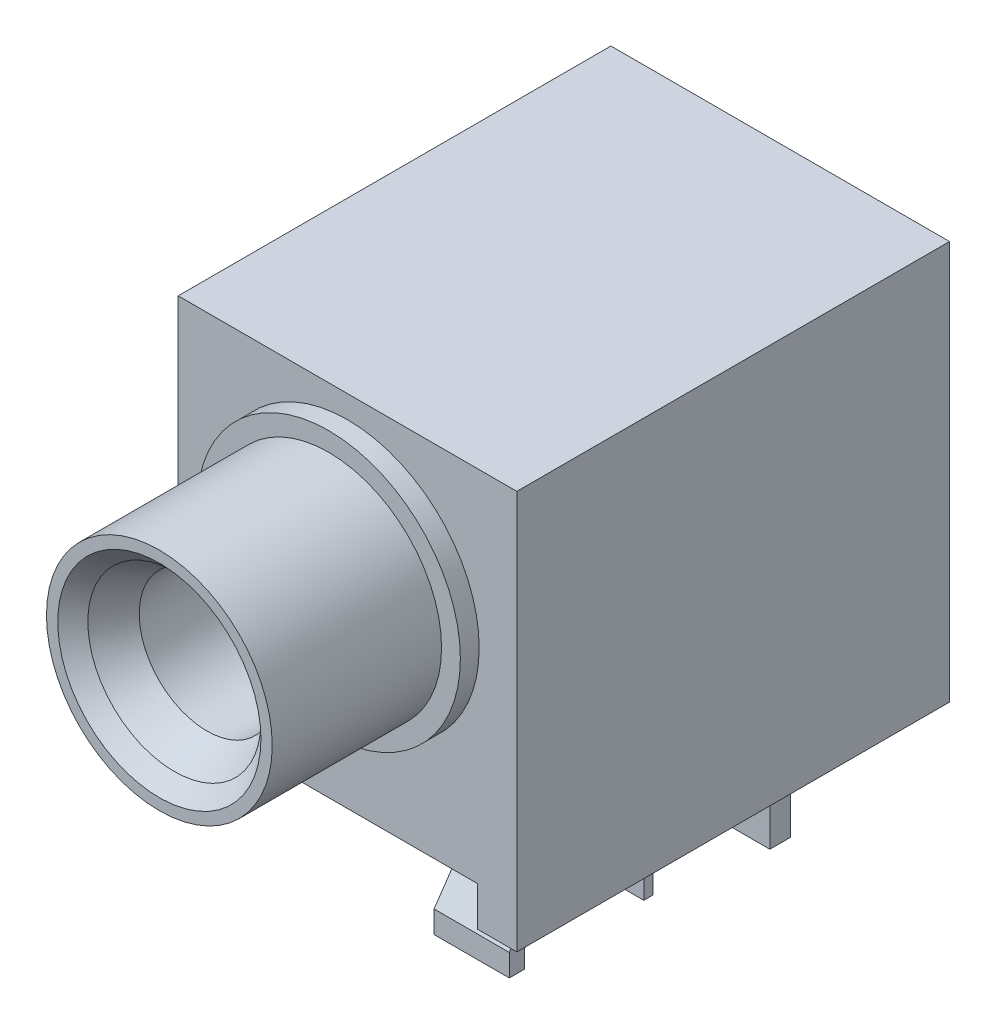
ISO-10303-21;
HEADER;
FILE_DESCRIPTION(('STEP AP214'),'2;1');
FILE_NAME('part.step','',(''),(''),'','','');
FILE_SCHEMA(('AUTOMOTIVE_DESIGN { 1 0 10303 214 1 1 1 1 }'));
ENDSEC;
DATA;
#1=APPLICATION_CONTEXT('core data for automotive mechanical design processes');
#2=APPLICATION_PROTOCOL_DEFINITION('international standard','automotive_design',2000,#1);
#3=PRODUCT_CONTEXT('',#1,'mechanical');
#4=PRODUCT('Part','Part','',(#3));
#5=PRODUCT_RELATED_PRODUCT_CATEGORY('part','',(#4));
#6=PRODUCT_DEFINITION_FORMATION('','',#4);
#7=PRODUCT_DEFINITION_CONTEXT('part definition',#1,'design');
#8=PRODUCT_DEFINITION('design','',#6,#7);
#9=PRODUCT_DEFINITION_SHAPE('','',#8);
#10=(LENGTH_UNIT() NAMED_UNIT(*) SI_UNIT(.MILLI.,.METRE.));
#11=(NAMED_UNIT(*) PLANE_ANGLE_UNIT() SI_UNIT($,.RADIAN.));
#12=(NAMED_UNIT(*) SI_UNIT($,.STERADIAN.) SOLID_ANGLE_UNIT());
#13=UNCERTAINTY_MEASURE_WITH_UNIT(LENGTH_MEASURE(1.E-05),#10,'distance_accuracy_value','');
#14=(GEOMETRIC_REPRESENTATION_CONTEXT(3) GLOBAL_UNCERTAINTY_ASSIGNED_CONTEXT((#13)) GLOBAL_UNIT_ASSIGNED_CONTEXT((#10,
#11,#12)) REPRESENTATION_CONTEXT('',''));
#15=CARTESIAN_POINT('',(0.,0.,0.));
#16=DIRECTION('',(0.,0.,1.));
#17=DIRECTION('',(1.,0.,0.));
#18=AXIS2_PLACEMENT_3D('',#15,#16,#17);
#19=CARTESIAN_POINT('',(1.,1.05,-10.225));
#20=DIRECTION('',(0.,0.,-1.));
#21=DIRECTION('',(-1.,0.,0.));
#22=AXIS2_PLACEMENT_3D('',#19,#20,#21);
#23=PLANE('',#22);
#24=DIRECTION('',(0.,-1.,0.));
#25=VECTOR('',#24,1.);
#26=CARTESIAN_POINT('',(-1.,1.05,-10.225));
#27=LINE('',#26,#25);
#28=CARTESIAN_POINT('',(-1.,1.05,-10.225));
#29=VERTEX_POINT('',#28);
#30=CARTESIAN_POINT('',(-1.,-4.5,-10.225));
#31=VERTEX_POINT('',#30);
#32=EDGE_CURVE('E109',#29,#31,#27,.T.);
#33=ORIENTED_EDGE('',*,*,#32,.T.);
#34=DIRECTION('',(-1.,0.,0.));
#35=VECTOR('',#34,1.);
#36=CARTESIAN_POINT('',(1.,-4.5,-10.225));
#37=LINE('',#36,#35);
#38=CARTESIAN_POINT('',(1.,-4.5,-10.225));
#39=VERTEX_POINT('',#38);
#40=EDGE_CURVE('E12',#39,#31,#37,.T.);
#41=ORIENTED_EDGE('',*,*,#40,.F.);
#42=DIRECTION('',(0.,-1.,0.));
#43=VECTOR('',#42,1.);
#44=CARTESIAN_POINT('',(1.,1.05,-10.225));
#45=LINE('',#44,#43);
#46=CARTESIAN_POINT('',(1.,1.05,-10.225));
#47=VERTEX_POINT('',#46);
#48=EDGE_CURVE('E97',#47,#39,#45,.T.);
#49=ORIENTED_EDGE('',*,*,#48,.F.);
#50=DIRECTION('',(-1.,0.,0.));
#51=VECTOR('',#50,1.);
#52=CARTESIAN_POINT('',(1.,1.05,-10.225));
#53=LINE('',#52,#51);
#54=EDGE_CURVE('E105',#47,#29,#53,.T.);
#55=ORIENTED_EDGE('',*,*,#54,.T.);
#56=EDGE_LOOP('',(#33,#41,#49,#55));
#57=FACE_BOUND('',#56,.T.);
#58=ADVANCED_FACE('F46',(#57),#23,.F.);
#59=CARTESIAN_POINT('',(1.,-4.5,-10.225));
#60=DIRECTION('',(0.,1.,0.));
#61=DIRECTION('',(0.,0.,1.));
#62=AXIS2_PLACEMENT_3D('',#59,#60,#61);
#63=PLANE('',#62);
#64=DIRECTION('',(0.,0.,-1.));
#65=VECTOR('',#64,1.);
#66=CARTESIAN_POINT('',(-1.,-4.5,-10.225));
#67=LINE('',#66,#65);
#68=CARTESIAN_POINT('',(-1.,-4.5,-10.775));
#69=VERTEX_POINT('',#68);
#70=EDGE_CURVE('E101',#31,#69,#67,.T.);
#71=ORIENTED_EDGE('',*,*,#70,.T.);
#72=DIRECTION('',(-1.,0.,0.));
#73=VECTOR('',#72,1.);
#74=CARTESIAN_POINT('',(1.,-4.5,-10.775));
#75=LINE('',#74,#73);
#76=CARTESIAN_POINT('',(1.,-4.5,-10.775));
#77=VERTEX_POINT('',#76);
#78=EDGE_CURVE('E54',#77,#69,#75,.T.);
#79=ORIENTED_EDGE('',*,*,#78,.F.);
#80=DIRECTION('',(0.,0.,-1.));
#81=VECTOR('',#80,1.);
#82=CARTESIAN_POINT('',(1.,-4.5,-10.225));
#83=LINE('',#82,#81);
#84=EDGE_CURVE('E92',#39,#77,#83,.T.);
#85=ORIENTED_EDGE('',*,*,#84,.F.);
#86=ORIENTED_EDGE('',*,*,#40,.T.);
#87=EDGE_LOOP('',(#71,#79,#85,#86));
#88=FACE_BOUND('',#87,.T.);
#89=ADVANCED_FACE('F100',(#88),#63,.F.);
#90=CARTESIAN_POINT('',(1.,1.05,-10.775));
#91=DIRECTION('',(0.,0.,1.));
#92=DIRECTION('',(0.,-1.,0.));
#93=AXIS2_PLACEMENT_3D('',#90,#91,#92);
#94=PLANE('',#93);
#95=DIRECTION('',(0.,1.,0.));
#96=VECTOR('',#95,1.);
#97=CARTESIAN_POINT('',(-1.,1.05,-10.775));
#98=LINE('',#97,#96);
#99=CARTESIAN_POINT('',(-1.,1.05,-10.775));
#100=VERTEX_POINT('',#99);
#101=EDGE_CURVE('E79',#69,#100,#98,.T.);
#102=ORIENTED_EDGE('',*,*,#101,.T.);
#103=DIRECTION('',(-1.,0.,0.));
#104=VECTOR('',#103,1.);
#105=CARTESIAN_POINT('',(1.,1.05,-10.775));
#106=LINE('',#105,#104);
#107=CARTESIAN_POINT('',(1.,1.05,-10.775));
#108=VERTEX_POINT('',#107);
#109=EDGE_CURVE('E102',#108,#100,#106,.T.);
#110=ORIENTED_EDGE('',*,*,#109,.F.);
#111=DIRECTION('',(0.,1.,0.));
#112=VECTOR('',#111,1.);
#113=CARTESIAN_POINT('',(1.,1.05,-10.775));
#114=LINE('',#113,#112);
#115=EDGE_CURVE('E95',#77,#108,#114,.T.);
#116=ORIENTED_EDGE('',*,*,#115,.F.);
#117=ORIENTED_EDGE('',*,*,#78,.T.);
#118=EDGE_LOOP('',(#102,#110,#116,#117));
#119=FACE_BOUND('',#118,.T.);
#120=ADVANCED_FACE('F103',(#119),#94,.F.);
#121=CARTESIAN_POINT('',(1.,1.05,-10.225));
#122=DIRECTION('',(0.,-1.,0.));
#123=DIRECTION('',(0.,0.,-1.));
#124=AXIS2_PLACEMENT_3D('',#121,#122,#123);
#125=PLANE('',#124);
#126=DIRECTION('',(0.,0.,1.));
#127=VECTOR('',#126,1.);
#128=CARTESIAN_POINT('',(-1.,1.05,-10.225));
#129=LINE('',#128,#127);
#130=EDGE_CURVE('E85',#100,#29,#129,.T.);
#131=ORIENTED_EDGE('',*,*,#130,.T.);
#132=ORIENTED_EDGE('',*,*,#54,.F.);
#133=DIRECTION('',(0.,0.,1.));
#134=VECTOR('',#133,1.);
#135=CARTESIAN_POINT('',(1.,1.05,-10.225));
#136=LINE('',#135,#134);
#137=EDGE_CURVE('E62',#108,#47,#136,.T.);
#138=ORIENTED_EDGE('',*,*,#137,.F.);
#139=ORIENTED_EDGE('',*,*,#109,.T.);
#140=EDGE_LOOP('',(#131,#132,#138,#139));
#141=FACE_BOUND('',#140,.T.);
#142=ADVANCED_FACE('F116',(#141),#125,.F.);
#143=CARTESIAN_POINT('',(1.,0.,0.));
#144=DIRECTION('',(1.,0.,0.));
#145=DIRECTION('',(0.,0.,-1.));
#146=AXIS2_PLACEMENT_3D('',#143,#144,#145);
#147=PLANE('',#146);
#148=ORIENTED_EDGE('',*,*,#48,.T.);
#149=ORIENTED_EDGE('',*,*,#84,.T.);
#150=ORIENTED_EDGE('',*,*,#115,.T.);
#151=ORIENTED_EDGE('',*,*,#137,.T.);
#152=EDGE_LOOP('',(#148,#149,#150,#151));
#153=FACE_BOUND('',#152,.T.);
#154=ADVANCED_FACE('F93',(#153),#147,.T.);
#155=CARTESIAN_POINT('',(-1.,0.,0.));
#156=DIRECTION('',(1.,0.,0.));
#157=DIRECTION('',(0.,0.,-1.));
#158=AXIS2_PLACEMENT_3D('',#155,#156,#157);
#159=PLANE('',#158);
#160=ORIENTED_EDGE('',*,*,#32,.F.);
#161=ORIENTED_EDGE('',*,*,#130,.F.);
#162=ORIENTED_EDGE('',*,*,#101,.F.);
#163=ORIENTED_EDGE('',*,*,#70,.F.);
#164=EDGE_LOOP('',(#160,#161,#162,#163));
#165=FACE_BOUND('',#164,.T.);
#166=ADVANCED_FACE('F119',(#165),#159,.F.);
#167=CLOSED_SHELL('',(#58,#89,#120,#142,#154,#166));
#168=MANIFOLD_SOLID_BREP('B2',#167);
#169=CARTESIAN_POINT('',(1.,1.05,-6.875));
#170=DIRECTION('',(0.,0.,-1.));
#171=DIRECTION('',(-1.,0.,0.));
#172=AXIS2_PLACEMENT_3D('',#169,#170,#171);
#173=PLANE('',#172);
#174=DIRECTION('',(0.,-1.,0.));
#175=VECTOR('',#174,1.);
#176=CARTESIAN_POINT('',(-1.,1.05,-6.875));
#177=LINE('',#176,#175);
#178=CARTESIAN_POINT('',(-1.,1.05,-6.875));
#179=VERTEX_POINT('',#178);
#180=CARTESIAN_POINT('',(-1.,-4.,-6.875));
#181=VERTEX_POINT('',#180);
#182=EDGE_CURVE('E243',#179,#181,#177,.T.);
#183=ORIENTED_EDGE('',*,*,#182,.T.);
#184=DIRECTION('',(-1.,0.,0.));
#185=VECTOR('',#184,1.);
#186=CARTESIAN_POINT('',(1.,-4.,-6.875));
#187=LINE('',#186,#185);
#188=CARTESIAN_POINT('',(1.,-4.,-6.875));
#189=VERTEX_POINT('',#188);
#190=EDGE_CURVE('E44',#189,#181,#187,.T.);
#191=ORIENTED_EDGE('',*,*,#190,.F.);
#192=DIRECTION('',(0.,-1.,0.));
#193=VECTOR('',#192,1.);
#194=CARTESIAN_POINT('',(1.,1.05,-6.875));
#195=LINE('',#194,#193);
#196=CARTESIAN_POINT('',(1.,1.05,-6.875));
#197=VERTEX_POINT('',#196);
#198=EDGE_CURVE('E231',#197,#189,#195,.T.);
#199=ORIENTED_EDGE('',*,*,#198,.F.);
#200=DIRECTION('',(-1.,0.,0.));
#201=VECTOR('',#200,1.);
#202=CARTESIAN_POINT('',(1.,1.05,-6.875));
#203=LINE('',#202,#201);
#204=EDGE_CURVE('E239',#197,#179,#203,.T.);
#205=ORIENTED_EDGE('',*,*,#204,.T.);
#206=EDGE_LOOP('',(#183,#191,#199,#205));
#207=FACE_BOUND('',#206,.T.);
#208=ADVANCED_FACE('F180',(#207),#173,.F.);
#209=CARTESIAN_POINT('',(1.,-4.,-6.875));
#210=DIRECTION('',(0.,1.,0.));
#211=DIRECTION('',(0.,0.,1.));
#212=AXIS2_PLACEMENT_3D('',#209,#210,#211);
#213=PLANE('',#212);
#214=DIRECTION('',(0.,0.,-1.));
#215=VECTOR('',#214,1.);
#216=CARTESIAN_POINT('',(-1.,-4.,-6.875));
#217=LINE('',#216,#215);
#218=CARTESIAN_POINT('',(-1.,-4.,-7.125));
#219=VERTEX_POINT('',#218);
#220=EDGE_CURVE('E235',#181,#219,#217,.T.);
#221=ORIENTED_EDGE('',*,*,#220,.T.);
#222=DIRECTION('',(-1.,0.,0.));
#223=VECTOR('',#222,1.);
#224=CARTESIAN_POINT('',(1.,-4.,-7.125));
#225=LINE('',#224,#223);
#226=CARTESIAN_POINT('',(1.,-4.,-7.125));
#227=VERTEX_POINT('',#226);
#228=EDGE_CURVE('E188',#227,#219,#225,.T.);
#229=ORIENTED_EDGE('',*,*,#228,.F.);
#230=DIRECTION('',(0.,0.,-1.));
#231=VECTOR('',#230,1.);
#232=CARTESIAN_POINT('',(1.,-4.,-6.875));
#233=LINE('',#232,#231);
#234=EDGE_CURVE('E226',#189,#227,#233,.T.);
#235=ORIENTED_EDGE('',*,*,#234,.F.);
#236=ORIENTED_EDGE('',*,*,#190,.T.);
#237=EDGE_LOOP('',(#221,#229,#235,#236));
#238=FACE_BOUND('',#237,.T.);
#239=ADVANCED_FACE('F234',(#238),#213,.F.);
#240=CARTESIAN_POINT('',(1.,1.05,-7.125));
#241=DIRECTION('',(0.,0.,1.));
#242=DIRECTION('',(0.,-1.,0.));
#243=AXIS2_PLACEMENT_3D('',#240,#241,#242);
#244=PLANE('',#243);
#245=DIRECTION('',(0.,1.,0.));
#246=VECTOR('',#245,1.);
#247=CARTESIAN_POINT('',(-1.,1.05,-7.125));
#248=LINE('',#247,#246);
#249=CARTESIAN_POINT('',(-1.,1.05,-7.125));
#250=VERTEX_POINT('',#249);
#251=EDGE_CURVE('E213',#219,#250,#248,.T.);
#252=ORIENTED_EDGE('',*,*,#251,.T.);
#253=DIRECTION('',(-1.,0.,0.));
#254=VECTOR('',#253,1.);
#255=CARTESIAN_POINT('',(1.,1.05,-7.125));
#256=LINE('',#255,#254);
#257=CARTESIAN_POINT('',(1.,1.05,-7.125));
#258=VERTEX_POINT('',#257);
#259=EDGE_CURVE('E236',#258,#250,#256,.T.);
#260=ORIENTED_EDGE('',*,*,#259,.F.);
#261=DIRECTION('',(0.,1.,0.));
#262=VECTOR('',#261,1.);
#263=CARTESIAN_POINT('',(1.,1.05,-7.125));
#264=LINE('',#263,#262);
#265=EDGE_CURVE('E229',#227,#258,#264,.T.);
#266=ORIENTED_EDGE('',*,*,#265,.F.);
#267=ORIENTED_EDGE('',*,*,#228,.T.);
#268=EDGE_LOOP('',(#252,#260,#266,#267));
#269=FACE_BOUND('',#268,.T.);
#270=ADVANCED_FACE('F237',(#269),#244,.F.);
#271=CARTESIAN_POINT('',(1.,1.05,-6.875));
#272=DIRECTION('',(0.,-1.,0.));
#273=DIRECTION('',(0.,0.,-1.));
#274=AXIS2_PLACEMENT_3D('',#271,#272,#273);
#275=PLANE('',#274);
#276=DIRECTION('',(0.,0.,1.));
#277=VECTOR('',#276,1.);
#278=CARTESIAN_POINT('',(-1.,1.05,-6.875));
#279=LINE('',#278,#277);
#280=EDGE_CURVE('E219',#250,#179,#279,.T.);
#281=ORIENTED_EDGE('',*,*,#280,.T.);
#282=ORIENTED_EDGE('',*,*,#204,.F.);
#283=DIRECTION('',(0.,0.,1.));
#284=VECTOR('',#283,1.);
#285=CARTESIAN_POINT('',(1.,1.05,-6.875));
#286=LINE('',#285,#284);
#287=EDGE_CURVE('E196',#258,#197,#286,.T.);
#288=ORIENTED_EDGE('',*,*,#287,.F.);
#289=ORIENTED_EDGE('',*,*,#259,.T.);
#290=EDGE_LOOP('',(#281,#282,#288,#289));
#291=FACE_BOUND('',#290,.T.);
#292=ADVANCED_FACE('F250',(#291),#275,.F.);
#293=CARTESIAN_POINT('',(1.,0.,0.));
#294=DIRECTION('',(1.,0.,0.));
#295=DIRECTION('',(0.,0.,-1.));
#296=AXIS2_PLACEMENT_3D('',#293,#294,#295);
#297=PLANE('',#296);
#298=ORIENTED_EDGE('',*,*,#198,.T.);
#299=ORIENTED_EDGE('',*,*,#234,.T.);
#300=ORIENTED_EDGE('',*,*,#265,.T.);
#301=ORIENTED_EDGE('',*,*,#287,.T.);
#302=EDGE_LOOP('',(#298,#299,#300,#301));
#303=FACE_BOUND('',#302,.T.);
#304=ADVANCED_FACE('F227',(#303),#297,.T.);
#305=CARTESIAN_POINT('',(-1.,0.,0.));
#306=DIRECTION('',(1.,0.,0.));
#307=DIRECTION('',(0.,0.,-1.));
#308=AXIS2_PLACEMENT_3D('',#305,#306,#307);
#309=PLANE('',#308);
#310=ORIENTED_EDGE('',*,*,#182,.F.);
#311=ORIENTED_EDGE('',*,*,#280,.F.);
#312=ORIENTED_EDGE('',*,*,#251,.F.);
#313=ORIENTED_EDGE('',*,*,#220,.F.);
#314=EDGE_LOOP('',(#310,#311,#312,#313));
#315=FACE_BOUND('',#314,.T.);
#316=ADVANCED_FACE('F253',(#315),#309,.F.);
#317=CLOSED_SHELL('',(#208,#239,#270,#292,#304,#316));
#318=MANIFOLD_SOLID_BREP('B6',#317);
#319=CARTESIAN_POINT('',(1.,1.05,-3.3));
#320=DIRECTION('',(0.,-1.,0.));
#321=DIRECTION('',(0.,0.,-1.));
#322=AXIS2_PLACEMENT_3D('',#319,#320,#321);
#323=PLANE('',#322);
#324=DIRECTION('',(0.,0.,1.));
#325=VECTOR('',#324,1.);
#326=CARTESIAN_POINT('',(-1.,1.05,-3.3));
#327=LINE('',#326,#325);
#328=CARTESIAN_POINT('',(-1.,1.05,-3.7));
#329=VERTEX_POINT('',#328);
#330=CARTESIAN_POINT('',(-1.,1.05,-3.3));
#331=VERTEX_POINT('',#330);
#332=EDGE_CURVE('E420',#329,#331,#327,.T.);
#333=ORIENTED_EDGE('',*,*,#332,.T.);
#334=DIRECTION('',(-1.,0.,0.));
#335=VECTOR('',#334,1.);
#336=CARTESIAN_POINT('',(1.,1.05,-3.3));
#337=LINE('',#336,#335);
#338=CARTESIAN_POINT('',(1.,1.05,-3.3));
#339=VERTEX_POINT('',#338);
#340=EDGE_CURVE('E178',#339,#331,#337,.T.);
#341=ORIENTED_EDGE('',*,*,#340,.F.);
#342=DIRECTION('',(0.,0.,1.));
#343=VECTOR('',#342,1.);
#344=CARTESIAN_POINT('',(1.,1.05,-3.3));
#345=LINE('',#344,#343);
#346=CARTESIAN_POINT('',(1.,1.05,-3.7));
#347=VERTEX_POINT('',#346);
#348=EDGE_CURVE('E438',#347,#339,#345,.T.);
#349=ORIENTED_EDGE('',*,*,#348,.F.);
#350=DIRECTION('',(-1.,0.,0.));
#351=VECTOR('',#350,1.);
#352=CARTESIAN_POINT('',(1.,1.05,-3.7));
#353=LINE('',#352,#351);
#354=EDGE_CURVE('E416',#347,#329,#353,.T.);
#355=ORIENTED_EDGE('',*,*,#354,.T.);
#356=EDGE_LOOP('',(#333,#341,#349,#355));
#357=FACE_BOUND('',#356,.T.);
#358=ADVANCED_FACE('F312',(#357),#323,.F.);
#359=CARTESIAN_POINT('',(1.,1.05,-3.3));
#360=DIRECTION('',(0.,0.,-1.));
#361=DIRECTION('',(-1.,0.,0.));
#362=AXIS2_PLACEMENT_3D('',#359,#360,#361);
#363=PLANE('',#362);
#364=DIRECTION('',(0.,-1.,0.));
#365=VECTOR('',#364,1.);
#366=CARTESIAN_POINT('',(-1.,1.05,-3.3));
#367=LINE('',#366,#365);
#368=CARTESIAN_POINT('',(-1.,-1.25532390354079,-3.3));
#369=VERTEX_POINT('',#368);
#370=EDGE_CURVE('E423',#331,#369,#367,.T.);
#371=ORIENTED_EDGE('',*,*,#370,.T.);
#372=DIRECTION('',(-1.,0.,0.));
#373=VECTOR('',#372,1.);
#374=CARTESIAN_POINT('',(1.,-1.25532390354079,-3.3));
#375=LINE('',#374,#373);
#376=CARTESIAN_POINT('',(1.,-1.25532390354079,-3.3));
#377=VERTEX_POINT('',#376);
#378=EDGE_CURVE('E320',#377,#369,#375,.T.);
#379=ORIENTED_EDGE('',*,*,#378,.F.);
#380=DIRECTION('',(0.,-1.,0.));
#381=VECTOR('',#380,1.);
#382=CARTESIAN_POINT('',(1.,1.05,-3.3));
#383=LINE('',#382,#381);
#384=EDGE_CURVE('E377',#339,#377,#383,.T.);
#385=ORIENTED_EDGE('',*,*,#384,.F.);
#386=ORIENTED_EDGE('',*,*,#340,.T.);
#387=EDGE_LOOP('',(#371,#379,#385,#386));
#388=FACE_BOUND('',#387,.T.);
#389=ADVANCED_FACE('F487',(#388),#363,.F.);
#390=CARTESIAN_POINT('',(1.,-1.25532390354079,-3.3));
#391=DIRECTION('',(0.,0.395016764616017,-0.918673911500862));
#392=DIRECTION('',(0.,0.918673911500862,0.395016764616017));
#393=AXIS2_PLACEMENT_3D('',#390,#391,#392);
#394=PLANE('',#393);
#395=DIRECTION('',(0.,-0.918673911500862,-0.395016764616017));
#396=VECTOR('',#395,1.);
#397=CARTESIAN_POINT('',(-1.,-1.25532390354079,-3.3));
#398=LINE('',#397,#396);
#399=CARTESIAN_POINT('',(-1.,-2.58180832601635,-3.87036950578448));
#400=VERTEX_POINT('',#399);
#401=EDGE_CURVE('E425',#369,#400,#398,.T.);
#402=ORIENTED_EDGE('',*,*,#401,.T.);
#403=DIRECTION('',(-1.,0.,0.));
#404=VECTOR('',#403,1.);
#405=CARTESIAN_POINT('',(1.,-2.58180832601635,-3.87036950578448));
#406=LINE('',#405,#404);
#407=CARTESIAN_POINT('',(1.,-2.58180832601635,-3.87036950578448));
#408=VERTEX_POINT('',#407);
#409=EDGE_CURVE('E451',#408,#400,#406,.T.);
#410=ORIENTED_EDGE('',*,*,#409,.F.);
#411=DIRECTION('',(0.,-0.918673911500862,-0.395016764616017));
#412=VECTOR('',#411,1.);
#413=CARTESIAN_POINT('',(1.,-1.25532390354079,-3.3));
#414=LINE('',#413,#412);
#415=EDGE_CURVE('E459',#377,#408,#414,.T.);
#416=ORIENTED_EDGE('',*,*,#415,.F.);
#417=ORIENTED_EDGE('',*,*,#378,.T.);
#418=EDGE_LOOP('',(#402,#410,#416,#417));
#419=FACE_BOUND('',#418,.T.);
#420=ADVANCED_FACE('F457',(#419),#394,.F.);
#421=CARTESIAN_POINT('',(1.,-2.58180832601635,-3.87036950578448));
#422=DIRECTION('',(0.,-0.567107452613384,-0.823643816944168));
#423=DIRECTION('',(0.,0.823643816944168,-0.567107452613384));
#424=AXIS2_PLACEMENT_3D('',#421,#422,#423);
#425=PLANE('',#424);
#426=DIRECTION('',(0.,-0.823643816944168,0.567107452613384));
#427=VECTOR('',#426,1.);
#428=CARTESIAN_POINT('',(-1.,-2.58180832601635,-3.87036950578448));
#429=LINE('',#428,#427);
#430=CARTESIAN_POINT('',(-1.,-3.41018981641646,-3.3));
#431=VERTEX_POINT('',#430);
#432=EDGE_CURVE('E427',#400,#431,#429,.T.);
#433=ORIENTED_EDGE('',*,*,#432,.T.);
#434=DIRECTION('',(-1.,0.,0.));
#435=VECTOR('',#434,1.);
#436=CARTESIAN_POINT('',(1.,-3.41018981641646,-3.3));
#437=LINE('',#436,#435);
#438=CARTESIAN_POINT('',(1.,-3.41018981641646,-3.3));
#439=VERTEX_POINT('',#438);
#440=EDGE_CURVE('E448',#439,#431,#437,.T.);
#441=ORIENTED_EDGE('',*,*,#440,.F.);
#442=DIRECTION('',(0.,-0.823643816944168,0.567107452613384));
#443=VECTOR('',#442,1.);
#444=CARTESIAN_POINT('',(1.,-2.58180832601635,-3.87036950578448));
#445=LINE('',#444,#443);
#446=EDGE_CURVE('E477',#408,#439,#445,.T.);
#447=ORIENTED_EDGE('',*,*,#446,.F.);
#448=ORIENTED_EDGE('',*,*,#409,.T.);
#449=EDGE_LOOP('',(#433,#441,#447,#448));
#450=FACE_BOUND('',#449,.T.);
#451=ADVANCED_FACE('F468',(#450),#425,.F.);
#452=CARTESIAN_POINT('',(1.,-3.41018981641646,-3.3));
#453=DIRECTION('',(0.,0.,-1.));
#454=DIRECTION('',(-1.,0.,0.));
#455=AXIS2_PLACEMENT_3D('',#452,#453,#454);
#456=PLANE('',#455);
#457=DIRECTION('',(0.,-1.,0.));
#458=VECTOR('',#457,1.);
#459=CARTESIAN_POINT('',(-1.,-3.41018981641646,-3.3));
#460=LINE('',#459,#458);
#461=CARTESIAN_POINT('',(-1.,-4.,-3.3));
#462=VERTEX_POINT('',#461);
#463=EDGE_CURVE('E429',#431,#462,#460,.T.);
#464=ORIENTED_EDGE('',*,*,#463,.T.);
#465=DIRECTION('',(-1.,0.,0.));
#466=VECTOR('',#465,1.);
#467=CARTESIAN_POINT('',(1.,-4.,-3.3));
#468=LINE('',#467,#466);
#469=CARTESIAN_POINT('',(1.,-4.,-3.3));
#470=VERTEX_POINT('',#469);
#471=EDGE_CURVE('E445',#470,#462,#468,.T.);
#472=ORIENTED_EDGE('',*,*,#471,.F.);
#473=DIRECTION('',(0.,-1.,0.));
#474=VECTOR('',#473,1.);
#475=CARTESIAN_POINT('',(1.,-3.41018981641646,-3.3));
#476=LINE('',#475,#474);
#477=EDGE_CURVE('E474',#439,#470,#476,.T.);
#478=ORIENTED_EDGE('',*,*,#477,.F.);
#479=ORIENTED_EDGE('',*,*,#440,.T.);
#480=EDGE_LOOP('',(#464,#472,#478,#479));
#481=FACE_BOUND('',#480,.T.);
#482=ADVANCED_FACE('F472',(#481),#456,.F.);
#483=CARTESIAN_POINT('',(1.,-4.,-3.3));
#484=DIRECTION('',(0.,1.,0.));
#485=DIRECTION('',(0.,0.,1.));
#486=AXIS2_PLACEMENT_3D('',#483,#484,#485);
#487=PLANE('',#486);
#488=DIRECTION('',(0.,0.,-1.));
#489=VECTOR('',#488,1.);
#490=CARTESIAN_POINT('',(-1.,-4.,-3.3));
#491=LINE('',#490,#489);
#492=CARTESIAN_POINT('',(-1.,-4.,-3.7));
#493=VERTEX_POINT('',#492);
#494=EDGE_CURVE('E431',#462,#493,#491,.T.);
#495=ORIENTED_EDGE('',*,*,#494,.T.);
#496=DIRECTION('',(-1.,0.,0.));
#497=VECTOR('',#496,1.);
#498=CARTESIAN_POINT('',(1.,-4.,-3.7));
#499=LINE('',#498,#497);
#500=CARTESIAN_POINT('',(1.,-4.,-3.7));
#501=VERTEX_POINT('',#500);
#502=EDGE_CURVE('E442',#501,#493,#499,.T.);
#503=ORIENTED_EDGE('',*,*,#502,.F.);
#504=DIRECTION('',(0.,0.,-1.));
#505=VECTOR('',#504,1.);
#506=CARTESIAN_POINT('',(1.,-4.,-3.3));
#507=LINE('',#506,#505);
#508=EDGE_CURVE('E476',#470,#501,#507,.T.);
#509=ORIENTED_EDGE('',*,*,#508,.F.);
#510=ORIENTED_EDGE('',*,*,#471,.T.);
#511=EDGE_LOOP('',(#495,#503,#509,#510));
#512=FACE_BOUND('',#511,.T.);
#513=ADVANCED_FACE('F499',(#512),#487,.F.);
#514=CARTESIAN_POINT('',(1.,-3.5345797761979,-3.7));
#515=DIRECTION('',(0.,0.,1.));
#516=DIRECTION('',(1.,0.,0.));
#517=AXIS2_PLACEMENT_3D('',#514,#515,#516);
#518=PLANE('',#517);
#519=DIRECTION('',(0.,1.,0.));
#520=VECTOR('',#519,1.);
#521=CARTESIAN_POINT('',(-1.,-3.5345797761979,-3.7));
#522=LINE('',#521,#520);
#523=CARTESIAN_POINT('',(-1.,-3.5345797761979,-3.7));
#524=VERTEX_POINT('',#523);
#525=EDGE_CURVE('E433',#493,#524,#522,.T.);
#526=ORIENTED_EDGE('',*,*,#525,.T.);
#527=DIRECTION('',(-1.,0.,0.));
#528=VECTOR('',#527,1.);
#529=CARTESIAN_POINT('',(1.,-3.5345797761979,-3.7));
#530=LINE('',#529,#528);
#531=CARTESIAN_POINT('',(1.,-3.5345797761979,-3.7));
#532=VERTEX_POINT('',#531);
#533=EDGE_CURVE('E411',#532,#524,#530,.T.);
#534=ORIENTED_EDGE('',*,*,#533,.F.);
#535=DIRECTION('',(0.,1.,0.));
#536=VECTOR('',#535,1.);
#537=CARTESIAN_POINT('',(1.,-3.5345797761979,-3.7));
#538=LINE('',#537,#536);
#539=EDGE_CURVE('E402',#501,#532,#538,.T.);
#540=ORIENTED_EDGE('',*,*,#539,.F.);
#541=ORIENTED_EDGE('',*,*,#502,.T.);
#542=EDGE_LOOP('',(#526,#534,#540,#541));
#543=FACE_BOUND('',#542,.T.);
#544=ADVANCED_FACE('F502',(#543),#518,.F.);
#545=CARTESIAN_POINT('',(1.,-2.62672176580393,-4.32509185769081));
#546=DIRECTION('',(0.,0.567107452613384,0.823643816944168));
#547=DIRECTION('',(0.,-0.823643816944168,0.567107452613384));
#548=AXIS2_PLACEMENT_3D('',#545,#546,#547);
#549=PLANE('',#548);
#550=DIRECTION('',(0.,0.823643816944168,-0.567107452613384));
#551=VECTOR('',#550,1.);
#552=CARTESIAN_POINT('',(-1.,-2.62672176580393,-4.32509185769081));
#553=LINE('',#552,#551);
#554=CARTESIAN_POINT('',(-1.,-2.62672176580393,-4.32509185769081));
#555=VERTEX_POINT('',#554);
#556=EDGE_CURVE('E410',#524,#555,#553,.T.);
#557=ORIENTED_EDGE('',*,*,#556,.T.);
#558=DIRECTION('',(-1.,0.,0.));
#559=VECTOR('',#558,1.);
#560=CARTESIAN_POINT('',(1.,-2.62672176580393,-4.32509185769081));
#561=LINE('',#560,#559);
#562=CARTESIAN_POINT('',(1.,-2.62672176580393,-4.32509185769081));
#563=VERTEX_POINT('',#562);
#564=EDGE_CURVE('E407',#563,#555,#561,.T.);
#565=ORIENTED_EDGE('',*,*,#564,.F.);
#566=DIRECTION('',(0.,0.823643816944168,-0.567107452613384));
#567=VECTOR('',#566,1.);
#568=CARTESIAN_POINT('',(1.,-2.62672176580393,-4.32509185769081));
#569=LINE('',#568,#567);
#570=EDGE_CURVE('E396',#532,#563,#569,.T.);
#571=ORIENTED_EDGE('',*,*,#570,.F.);
#572=ORIENTED_EDGE('',*,*,#533,.T.);
#573=EDGE_LOOP('',(#557,#565,#571,#572));
#574=FACE_BOUND('',#573,.T.);
#575=ADVANCED_FACE('F408',(#574),#549,.F.);
#576=CARTESIAN_POINT('',(1.,-1.17297186607404,-3.7));
#577=DIRECTION('',(0.,-0.395016764616017,0.918673911500862));
#578=DIRECTION('',(0.,-0.918673911500862,-0.395016764616017));
#579=AXIS2_PLACEMENT_3D('',#576,#577,#578);
#580=PLANE('',#579);
#581=DIRECTION('',(0.,0.918673911500862,0.395016764616017));
#582=VECTOR('',#581,1.);
#583=CARTESIAN_POINT('',(-1.,-1.17297186607404,-3.7));
#584=LINE('',#583,#582);
#585=CARTESIAN_POINT('',(-1.,-1.17297186607404,-3.7));
#586=VERTEX_POINT('',#585);
#587=EDGE_CURVE('E363',#555,#586,#584,.T.);
#588=ORIENTED_EDGE('',*,*,#587,.T.);
#589=DIRECTION('',(-1.,0.,0.));
#590=VECTOR('',#589,1.);
#591=CARTESIAN_POINT('',(1.,-1.17297186607404,-3.7));
#592=LINE('',#591,#590);
#593=CARTESIAN_POINT('',(1.,-1.17297186607404,-3.7));
#594=VERTEX_POINT('',#593);
#595=EDGE_CURVE('E412',#594,#586,#592,.T.);
#596=ORIENTED_EDGE('',*,*,#595,.F.);
#597=DIRECTION('',(0.,0.918673911500862,0.395016764616017));
#598=VECTOR('',#597,1.);
#599=CARTESIAN_POINT('',(1.,-1.17297186607404,-3.7));
#600=LINE('',#599,#598);
#601=EDGE_CURVE('E400',#563,#594,#600,.T.);
#602=ORIENTED_EDGE('',*,*,#601,.F.);
#603=ORIENTED_EDGE('',*,*,#564,.T.);
#604=EDGE_LOOP('',(#588,#596,#602,#603));
#605=FACE_BOUND('',#604,.T.);
#606=ADVANCED_FACE('F414',(#605),#580,.F.);
#607=CARTESIAN_POINT('',(1.,1.05,-3.7));
#608=DIRECTION('',(0.,0.,1.));
#609=DIRECTION('',(0.,-1.,0.));
#610=AXIS2_PLACEMENT_3D('',#607,#608,#609);
#611=PLANE('',#610);
#612=DIRECTION('',(0.,1.,0.));
#613=VECTOR('',#612,1.);
#614=CARTESIAN_POINT('',(-1.,1.05,-3.7));
#615=LINE('',#614,#613);
#616=EDGE_CURVE('E369',#586,#329,#615,.T.);
#617=ORIENTED_EDGE('',*,*,#616,.T.);
#618=ORIENTED_EDGE('',*,*,#354,.F.);
#619=DIRECTION('',(0.,1.,0.));
#620=VECTOR('',#619,1.);
#621=CARTESIAN_POINT('',(1.,1.05,-3.7));
#622=LINE('',#621,#620);
#623=EDGE_CURVE('E328',#594,#347,#622,.T.);
#624=ORIENTED_EDGE('',*,*,#623,.F.);
#625=ORIENTED_EDGE('',*,*,#595,.T.);
#626=EDGE_LOOP('',(#617,#618,#624,#625));
#627=FACE_BOUND('',#626,.T.);
#628=ADVANCED_FACE('F511',(#627),#611,.F.);
#629=CARTESIAN_POINT('',(1.,0.,0.));
#630=DIRECTION('',(-1.,0.,0.));
#631=DIRECTION('',(0.,0.,1.));
#632=AXIS2_PLACEMENT_3D('',#629,#630,#631);
#633=PLANE('',#632);
#634=ORIENTED_EDGE('',*,*,#348,.T.);
#635=ORIENTED_EDGE('',*,*,#384,.T.);
#636=ORIENTED_EDGE('',*,*,#415,.T.);
#637=ORIENTED_EDGE('',*,*,#446,.T.);
#638=ORIENTED_EDGE('',*,*,#477,.T.);
#639=ORIENTED_EDGE('',*,*,#508,.T.);
#640=ORIENTED_EDGE('',*,*,#539,.T.);
#641=ORIENTED_EDGE('',*,*,#570,.T.);
#642=ORIENTED_EDGE('',*,*,#601,.T.);
#643=ORIENTED_EDGE('',*,*,#623,.T.);
#644=EDGE_LOOP('',(#634,#635,#636,#637,#638,#639,#640,#641,#642,#643));
#645=FACE_BOUND('',#644,.T.);
#646=ADVANCED_FACE('F398',(#645),#633,.F.);
#647=CARTESIAN_POINT('',(-1.,0.,0.));
#648=DIRECTION('',(-1.,0.,0.));
#649=DIRECTION('',(0.,0.,1.));
#650=AXIS2_PLACEMENT_3D('',#647,#648,#649);
#651=PLANE('',#650);
#652=ORIENTED_EDGE('',*,*,#332,.F.);
#653=ORIENTED_EDGE('',*,*,#616,.F.);
#654=ORIENTED_EDGE('',*,*,#587,.F.);
#655=ORIENTED_EDGE('',*,*,#556,.F.);
#656=ORIENTED_EDGE('',*,*,#525,.F.);
#657=ORIENTED_EDGE('',*,*,#494,.F.);
#658=ORIENTED_EDGE('',*,*,#463,.F.);
#659=ORIENTED_EDGE('',*,*,#432,.F.);
#660=ORIENTED_EDGE('',*,*,#401,.F.);
#661=ORIENTED_EDGE('',*,*,#370,.F.);
#662=EDGE_LOOP('',(#652,#653,#654,#655,#656,#657,#658,#659,#660,#661));
#663=FACE_BOUND('',#662,.T.);
#664=ADVANCED_FACE('F463',(#663),#651,.T.);
#665=CLOSED_SHELL('',(#358,#389,#420,#451,#482,#513,#544,#575,#606,#628,#646,#664));
#666=MANIFOLD_SOLID_BREP('B38',#665);
#667=CARTESIAN_POINT('',(0.,6.5,0.5));
#668=DIRECTION('',(0.,0.,-1.));
#669=DIRECTION('',(-1.,0.,0.));
#670=AXIS2_PLACEMENT_3D('',#667,#668,#669);
#671=CYLINDRICAL_SURFACE('',#670,3.5);
#672=CARTESIAN_POINT('',(0.,6.5,0.5));
#673=DIRECTION('',(0.,0.,1.));
#674=DIRECTION('',(1.,0.,0.));
#675=AXIS2_PLACEMENT_3D('',#672,#673,#674);
#676=CIRCLE('',#675,3.5);
#677=CARTESIAN_POINT('',(3.5,6.5,0.5));
#678=VERTEX_POINT('',#677);
#679=EDGE_CURVE('E311',#678,#678,#676,.T.);
#680=ORIENTED_EDGE('',*,*,#679,.F.);
#681=EDGE_LOOP('',(#680));
#682=FACE_BOUND('',#681,.T.);
#683=CARTESIAN_POINT('',(0.,6.5,0.));
#684=DIRECTION('',(0.,0.,1.));
#685=DIRECTION('',(1.,0.,0.));
#686=AXIS2_PLACEMENT_3D('',#683,#684,#685);
#687=CIRCLE('',#686,3.5);
#688=CARTESIAN_POINT('',(3.5,6.5,0.));
#689=VERTEX_POINT('',#688);
#690=EDGE_CURVE('E604',#689,#689,#687,.T.);
#691=ORIENTED_EDGE('',*,*,#690,.T.);
#692=EDGE_LOOP('',(#691));
#693=FACE_BOUND('',#692,.T.);
#694=ADVANCED_FACE('F601',(#682,#693),#671,.T.);
#695=CARTESIAN_POINT('',(0.,6.5,0.5));
#696=DIRECTION('',(0.,0.,1.));
#697=DIRECTION('',(1.,0.,0.));
#698=AXIS2_PLACEMENT_3D('',#695,#696,#697);
#699=PLANE('',#698);
#700=CARTESIAN_POINT('',(0.,6.5,0.5));
#701=DIRECTION('',(0.,0.,1.));
#702=DIRECTION('',(1.,0.,0.));
#703=AXIS2_PLACEMENT_3D('',#700,#701,#702);
#704=CIRCLE('',#703,3.);
#705=CARTESIAN_POINT('',(3.,6.5,0.5));
#706=VERTEX_POINT('',#705);
#707=EDGE_CURVE('E613',#706,#706,#704,.T.);
#708=ORIENTED_EDGE('',*,*,#707,.F.);
#709=EDGE_LOOP('',(#708));
#710=FACE_BOUND('',#709,.T.);
#711=ORIENTED_EDGE('',*,*,#679,.T.);
#712=EDGE_LOOP('',(#711));
#713=FACE_BOUND('',#712,.T.);
#714=ADVANCED_FACE('F647',(#710,#713),#699,.T.);
#715=CARTESIAN_POINT('',(0.,6.5,0.));
#716=DIRECTION('',(0.,0.,1.));
#717=DIRECTION('',(1.,0.,0.));
#718=AXIS2_PLACEMENT_3D('',#715,#716,#717);
#719=PLANE('',#718);
#720=CARTESIAN_POINT('',(0.,6.5,0.));
#721=DIRECTION('',(0.,0.,1.));
#722=DIRECTION('',(1.,0.,0.));
#723=AXIS2_PLACEMENT_3D('',#720,#721,#722);
#724=CIRCLE('',#723,1.8);
#725=CARTESIAN_POINT('',(1.8,6.5,0.));
#726=VERTEX_POINT('',#725);
#727=EDGE_CURVE('E616',#726,#726,#724,.T.);
#728=ORIENTED_EDGE('',*,*,#727,.T.);
#729=EDGE_LOOP('',(#728));
#730=FACE_BOUND('',#729,.T.);
#731=ORIENTED_EDGE('',*,*,#690,.F.);
#732=EDGE_LOOP('',(#731));
#733=FACE_BOUND('',#732,.T.);
#734=ADVANCED_FACE('F643',(#730,#733),#719,.F.);
#735=CARTESIAN_POINT('',(0.,6.5,5.));
#736=DIRECTION('',(0.,0.,-1.));
#737=DIRECTION('',(-1.,0.,0.));
#738=AXIS2_PLACEMENT_3D('',#735,#736,#737);
#739=CYLINDRICAL_SURFACE('',#738,3.);
#740=CARTESIAN_POINT('',(0.,6.5,5.));
#741=DIRECTION('',(0.,0.,1.));
#742=DIRECTION('',(1.,0.,0.));
#743=AXIS2_PLACEMENT_3D('',#740,#741,#742);
#744=CIRCLE('',#743,3.);
#745=CARTESIAN_POINT('',(3.,6.5,5.));
#746=VERTEX_POINT('',#745);
#747=EDGE_CURVE('E611',#746,#746,#744,.T.);
#748=ORIENTED_EDGE('',*,*,#747,.F.);
#749=EDGE_LOOP('',(#748));
#750=FACE_BOUND('',#749,.T.);
#751=ORIENTED_EDGE('',*,*,#707,.T.);
#752=EDGE_LOOP('',(#751));
#753=FACE_BOUND('',#752,.T.);
#754=ADVANCED_FACE('F637',(#750,#753),#739,.T.);
#755=CARTESIAN_POINT('',(0.,6.5,5.));
#756=DIRECTION('',(0.,0.,1.));
#757=DIRECTION('',(1.,0.,0.));
#758=AXIS2_PLACEMENT_3D('',#755,#756,#757);
#759=PLANE('',#758);
#760=CARTESIAN_POINT('',(0.,6.5,5.));
#761=DIRECTION('',(0.,0.,1.));
#762=DIRECTION('',(1.,0.,0.));
#763=AXIS2_PLACEMENT_3D('',#760,#761,#762);
#764=CIRCLE('',#763,2.7);
#765=CARTESIAN_POINT('',(2.7,6.5,5.));
#766=VERTEX_POINT('',#765);
#767=EDGE_CURVE('E627',#766,#766,#764,.T.);
#768=ORIENTED_EDGE('',*,*,#767,.F.);
#769=EDGE_LOOP('',(#768));
#770=FACE_BOUND('',#769,.T.);
#771=ORIENTED_EDGE('',*,*,#747,.T.);
#772=EDGE_LOOP('',(#771));
#773=FACE_BOUND('',#772,.T.);
#774=ADVANCED_FACE('F633',(#770,#773),#759,.T.);
#775=CARTESIAN_POINT('',(0.,6.5,5.));
#776=DIRECTION('',(0.,0.,1.));
#777=DIRECTION('',(1.,0.,0.));
#778=AXIS2_PLACEMENT_3D('',#775,#776,#777);
#779=CYLINDRICAL_SURFACE('',#778,1.8);
#780=ORIENTED_EDGE('',*,*,#727,.F.);
#781=EDGE_LOOP('',(#780));
#782=FACE_BOUND('',#781,.T.);
#783=CARTESIAN_POINT('',(0.,6.5,3.73397459621556));
#784=DIRECTION('',(0.,0.,1.));
#785=DIRECTION('',(1.,0.,0.));
#786=AXIS2_PLACEMENT_3D('',#783,#784,#785);
#787=CIRCLE('',#786,1.8);
#788=CARTESIAN_POINT('',(1.8,6.5,3.73397459621556));
#789=VERTEX_POINT('',#788);
#790=EDGE_CURVE('E621',#789,#789,#787,.T.);
#791=ORIENTED_EDGE('',*,*,#790,.T.);
#792=EDGE_LOOP('',(#791));
#793=FACE_BOUND('',#792,.T.);
#794=ADVANCED_FACE('F636',(#782,#793),#779,.F.);
#795=CARTESIAN_POINT('',(0.,6.5,4.6));
#796=DIRECTION('',(0.,0.,1.));
#797=DIRECTION('',(1.,0.,0.));
#798=AXIS2_PLACEMENT_3D('',#795,#796,#797);
#799=CONICAL_SURFACE('',#798,2.3,0.523598775598297);
#800=ORIENTED_EDGE('',*,*,#790,.F.);
#801=EDGE_LOOP('',(#800));
#802=FACE_BOUND('',#801,.T.);
#803=CARTESIAN_POINT('',(0.,6.5,4.6));
#804=DIRECTION('',(0.,0.,1.));
#805=DIRECTION('',(1.,0.,0.));
#806=AXIS2_PLACEMENT_3D('',#803,#804,#805);
#807=CIRCLE('',#806,2.3);
#808=CARTESIAN_POINT('',(2.3,6.5,4.6));
#809=VERTEX_POINT('',#808);
#810=EDGE_CURVE('E624',#809,#809,#807,.T.);
#811=ORIENTED_EDGE('',*,*,#810,.T.);
#812=EDGE_LOOP('',(#811));
#813=FACE_BOUND('',#812,.T.);
#814=ADVANCED_FACE('F659',(#802,#813),#799,.F.);
#815=CARTESIAN_POINT('',(0.,6.5,5.));
#816=DIRECTION('',(0.,0.,1.));
#817=DIRECTION('',(1.,0.,0.));
#818=AXIS2_PLACEMENT_3D('',#815,#816,#817);
#819=CONICAL_SURFACE('',#818,2.7,0.785398163397447);
#820=ORIENTED_EDGE('',*,*,#810,.F.);
#821=EDGE_LOOP('',(#820));
#822=FACE_BOUND('',#821,.T.);
#823=ORIENTED_EDGE('',*,*,#767,.T.);
#824=EDGE_LOOP('',(#823));
#825=FACE_BOUND('',#824,.T.);
#826=ADVANCED_FACE('F631',(#822,#825),#819,.F.);
#827=CLOSED_SHELL('',(#694,#714,#734,#754,#774,#794,#814,#826));
#828=MANIFOLD_SOLID_BREP('B172',#827);
#829=CARTESIAN_POINT('',(-4.5,10.6,-11.5));
#830=DIRECTION('',(-1.,0.,0.));
#831=DIRECTION('',(0.,-1.,0.));
#832=AXIS2_PLACEMENT_3D('',#829,#830,#831);
#833=PLANE('',#832);
#834=DIRECTION('',(0.,-1.,0.));
#835=VECTOR('',#834,1.);
#836=CARTESIAN_POINT('',(-4.5,10.6,0.));
#837=LINE('',#836,#835);
#838=CARTESIAN_POINT('',(-4.5,10.6,0.));
#839=VERTEX_POINT('',#838);
#840=CARTESIAN_POINT('',(-4.5,0.,0.));
#841=VERTEX_POINT('',#840);
#842=EDGE_CURVE('E819',#839,#841,#837,.T.);
#843=ORIENTED_EDGE('',*,*,#842,.F.);
#844=DIRECTION('',(0.,0.,1.));
#845=VECTOR('',#844,1.);
#846=CARTESIAN_POINT('',(-4.5,10.6,-11.5));
#847=LINE('',#846,#845);
#848=CARTESIAN_POINT('',(-4.5,10.6,-11.5));
#849=VERTEX_POINT('',#848);
#850=EDGE_CURVE('E599',#849,#839,#847,.T.);
#851=ORIENTED_EDGE('',*,*,#850,.F.);
#852=DIRECTION('',(0.,-1.,0.));
#853=VECTOR('',#852,1.);
#854=CARTESIAN_POINT('',(-4.5,10.6,-11.5));
#855=LINE('',#854,#853);
#856=CARTESIAN_POINT('',(-4.5,0.,-11.5));
#857=VERTEX_POINT('',#856);
#858=EDGE_CURVE('E839',#849,#857,#855,.T.);
#859=ORIENTED_EDGE('',*,*,#858,.T.);
#860=DIRECTION('',(0.,0.,1.));
#861=VECTOR('',#860,1.);
#862=CARTESIAN_POINT('',(-4.5,0.,-11.5));
#863=LINE('',#862,#861);
#864=EDGE_CURVE('E725',#857,#841,#863,.T.);
#865=ORIENTED_EDGE('',*,*,#864,.T.);
#866=EDGE_LOOP('',(#843,#851,#859,#865));
#867=FACE_BOUND('',#866,.T.);
#868=ADVANCED_FACE('F722',(#867),#833,.T.);
#869=CARTESIAN_POINT('',(-4.5,10.6,-11.5));
#870=DIRECTION('',(0.,1.,0.));
#871=DIRECTION('',(-1.,0.,0.));
#872=AXIS2_PLACEMENT_3D('',#869,#870,#871);
#873=PLANE('',#872);
#874=DIRECTION('',(-1.,0.,0.));
#875=VECTOR('',#874,1.);
#876=CARTESIAN_POINT('',(-4.5,10.6,0.));
#877=LINE('',#876,#875);
#878=CARTESIAN_POINT('',(4.5,10.6,0.));
#879=VERTEX_POINT('',#878);
#880=EDGE_CURVE('E837',#879,#839,#877,.T.);
#881=ORIENTED_EDGE('',*,*,#880,.F.);
#882=DIRECTION('',(0.,0.,1.));
#883=VECTOR('',#882,1.);
#884=CARTESIAN_POINT('',(4.5,10.6,-11.5));
#885=LINE('',#884,#883);
#886=CARTESIAN_POINT('',(4.5,10.6,-11.5));
#887=VERTEX_POINT('',#886);
#888=EDGE_CURVE('E731',#887,#879,#885,.T.);
#889=ORIENTED_EDGE('',*,*,#888,.F.);
#890=DIRECTION('',(-1.,0.,0.));
#891=VECTOR('',#890,1.);
#892=CARTESIAN_POINT('',(-4.5,10.6,-11.5));
#893=LINE('',#892,#891);
#894=EDGE_CURVE('E809',#887,#849,#893,.T.);
#895=ORIENTED_EDGE('',*,*,#894,.T.);
#896=ORIENTED_EDGE('',*,*,#850,.T.);
#897=EDGE_LOOP('',(#881,#889,#895,#896));
#898=FACE_BOUND('',#897,.T.);
#899=ADVANCED_FACE('F851',(#898),#873,.T.);
#900=CARTESIAN_POINT('',(4.5,10.6,-11.5));
#901=DIRECTION('',(1.,0.,0.));
#902=DIRECTION('',(0.,1.,0.));
#903=AXIS2_PLACEMENT_3D('',#900,#901,#902);
#904=PLANE('',#903);
#905=DIRECTION('',(0.,1.,0.));
#906=VECTOR('',#905,1.);
#907=CARTESIAN_POINT('',(4.5,10.6,0.));
#908=LINE('',#907,#906);
#909=CARTESIAN_POINT('',(4.50000000000001,0.,0.));
#910=VERTEX_POINT('',#909);
#911=EDGE_CURVE('E796',#910,#879,#908,.T.);
#912=ORIENTED_EDGE('',*,*,#911,.F.);
#913=DIRECTION('',(0.,0.,1.));
#914=VECTOR('',#913,1.);
#915=CARTESIAN_POINT('',(4.50000000000001,0.,-11.5));
#916=LINE('',#915,#914);
#917=CARTESIAN_POINT('',(4.50000000000001,0.,-11.5));
#918=VERTEX_POINT('',#917);
#919=EDGE_CURVE('E791',#918,#910,#916,.T.);
#920=ORIENTED_EDGE('',*,*,#919,.F.);
#921=DIRECTION('',(0.,1.,0.));
#922=VECTOR('',#921,1.);
#923=CARTESIAN_POINT('',(4.5,10.6,-11.5));
#924=LINE('',#923,#922);
#925=EDGE_CURVE('E794',#918,#887,#924,.T.);
#926=ORIENTED_EDGE('',*,*,#925,.T.);
#927=ORIENTED_EDGE('',*,*,#888,.T.);
#928=EDGE_LOOP('',(#912,#920,#926,#927));
#929=FACE_BOUND('',#928,.T.);
#930=ADVANCED_FACE('F793',(#929),#904,.T.);
#931=CARTESIAN_POINT('',(4.50000000000001,0.,-11.5));
#932=DIRECTION('',(0.,-1.,0.));
#933=DIRECTION('',(1.,0.,0.));
#934=AXIS2_PLACEMENT_3D('',#931,#932,#933);
#935=PLANE('',#934);
#936=DIRECTION('',(1.,0.,0.));
#937=VECTOR('',#936,1.);
#938=CARTESIAN_POINT('',(4.50000000000001,0.,0.));
#939=LINE('',#938,#937);
#940=CARTESIAN_POINT('',(3.45000000000001,0.,0.));
#941=VERTEX_POINT('',#940);
#942=EDGE_CURVE('E834',#941,#910,#939,.T.);
#943=ORIENTED_EDGE('',*,*,#942,.F.);
#944=DIRECTION('',(0.,0.,1.));
#945=VECTOR('',#944,1.);
#946=CARTESIAN_POINT('',(3.45000000000001,0.,-11.5));
#947=LINE('',#946,#945);
#948=CARTESIAN_POINT('',(3.45000000000001,0.,-11.5));
#949=VERTEX_POINT('',#948);
#950=EDGE_CURVE('E801',#949,#941,#947,.T.);
#951=ORIENTED_EDGE('',*,*,#950,.F.);
#952=DIRECTION('',(1.,0.,0.));
#953=VECTOR('',#952,1.);
#954=CARTESIAN_POINT('',(4.50000000000001,0.,-11.5));
#955=LINE('',#954,#953);
#956=EDGE_CURVE('E807',#949,#918,#955,.T.);
#957=ORIENTED_EDGE('',*,*,#956,.T.);
#958=ORIENTED_EDGE('',*,*,#919,.T.);
#959=EDGE_LOOP('',(#943,#951,#957,#958));
#960=FACE_BOUND('',#959,.T.);
#961=ADVANCED_FACE('F811',(#960),#935,.T.);
#962=CARTESIAN_POINT('',(3.45000000000001,0.,-11.5));
#963=DIRECTION('',(-1.,0.,0.));
#964=DIRECTION('',(0.,-1.,0.));
#965=AXIS2_PLACEMENT_3D('',#962,#963,#964);
#966=PLANE('',#965);
#967=DIRECTION('',(0.,-1.,0.));
#968=VECTOR('',#967,1.);
#969=CARTESIAN_POINT('',(3.45000000000001,0.,0.));
#970=LINE('',#969,#968);
#971=CARTESIAN_POINT('',(3.45000000000001,1.05,0.));
#972=VERTEX_POINT('',#971);
#973=EDGE_CURVE('E831',#972,#941,#970,.T.);
#974=ORIENTED_EDGE('',*,*,#973,.F.);
#975=DIRECTION('',(0.,0.,1.));
#976=VECTOR('',#975,1.);
#977=CARTESIAN_POINT('',(3.45000000000001,1.05,-11.5));
#978=LINE('',#977,#976);
#979=CARTESIAN_POINT('',(3.45000000000001,1.05,-11.5));
#980=VERTEX_POINT('',#979);
#981=EDGE_CURVE('E843',#980,#972,#978,.T.);
#982=ORIENTED_EDGE('',*,*,#981,.F.);
#983=DIRECTION('',(0.,-1.,0.));
#984=VECTOR('',#983,1.);
#985=CARTESIAN_POINT('',(3.45000000000001,0.,-11.5));
#986=LINE('',#985,#984);
#987=EDGE_CURVE('E812',#980,#949,#986,.T.);
#988=ORIENTED_EDGE('',*,*,#987,.T.);
#989=ORIENTED_EDGE('',*,*,#950,.T.);
#990=EDGE_LOOP('',(#974,#982,#988,#989));
#991=FACE_BOUND('',#990,.T.);
#992=ADVANCED_FACE('F864',(#991),#966,.T.);
#993=CARTESIAN_POINT('',(-3.45,1.05,-11.5));
#994=DIRECTION('',(0.,-1.,0.));
#995=DIRECTION('',(1.,0.,0.));
#996=AXIS2_PLACEMENT_3D('',#993,#994,#995);
#997=PLANE('',#996);
#998=DIRECTION('',(1.,0.,0.));
#999=VECTOR('',#998,1.);
#1000=CARTESIAN_POINT('',(-3.45,1.05,0.));
#1001=LINE('',#1000,#999);
#1002=CARTESIAN_POINT('',(-3.45,1.05,0.));
#1003=VERTEX_POINT('',#1002);
#1004=EDGE_CURVE('E828',#1003,#972,#1001,.T.);
#1005=ORIENTED_EDGE('',*,*,#1004,.F.);
#1006=DIRECTION('',(0.,0.,1.));
#1007=VECTOR('',#1006,1.);
#1008=CARTESIAN_POINT('',(-3.45,1.05,-11.5));
#1009=LINE('',#1008,#1007);
#1010=CARTESIAN_POINT('',(-3.45,1.05,-11.5));
#1011=VERTEX_POINT('',#1010);
#1012=EDGE_CURVE('E845',#1011,#1003,#1009,.T.);
#1013=ORIENTED_EDGE('',*,*,#1012,.F.);
#1014=DIRECTION('',(1.,0.,0.));
#1015=VECTOR('',#1014,1.);
#1016=CARTESIAN_POINT('',(-3.45,1.05,-11.5));
#1017=LINE('',#1016,#1015);
#1018=EDGE_CURVE('E814',#1011,#980,#1017,.T.);
#1019=ORIENTED_EDGE('',*,*,#1018,.T.);
#1020=ORIENTED_EDGE('',*,*,#981,.T.);
#1021=EDGE_LOOP('',(#1005,#1013,#1019,#1020));
#1022=FACE_BOUND('',#1021,.T.);
#1023=ADVANCED_FACE('F867',(#1022),#997,.T.);
#1024=CARTESIAN_POINT('',(-3.45,0.,-11.5));
#1025=DIRECTION('',(1.,0.,0.));
#1026=DIRECTION('',(0.,0.,-1.));
#1027=AXIS2_PLACEMENT_3D('',#1024,#1025,#1026);
#1028=PLANE('',#1027);
#1029=DIRECTION('',(0.,1.,0.));
#1030=VECTOR('',#1029,1.);
#1031=CARTESIAN_POINT('',(-3.45,0.,0.));
#1032=LINE('',#1031,#1030);
#1033=CARTESIAN_POINT('',(-3.45,0.,0.));
#1034=VERTEX_POINT('',#1033);
#1035=EDGE_CURVE('E825',#1034,#1003,#1032,.T.);
#1036=ORIENTED_EDGE('',*,*,#1035,.F.);
#1037=DIRECTION('',(0.,0.,1.));
#1038=VECTOR('',#1037,1.);
#1039=CARTESIAN_POINT('',(-3.45,0.,-11.5));
#1040=LINE('',#1039,#1038);
#1041=CARTESIAN_POINT('',(-3.45,0.,-11.5));
#1042=VERTEX_POINT('',#1041);
#1043=EDGE_CURVE('E846',#1042,#1034,#1040,.T.);
#1044=ORIENTED_EDGE('',*,*,#1043,.F.);
#1045=DIRECTION('',(0.,1.,0.));
#1046=VECTOR('',#1045,1.);
#1047=CARTESIAN_POINT('',(-3.45,0.,-11.5));
#1048=LINE('',#1047,#1046);
#1049=EDGE_CURVE('E942',#1042,#1011,#1048,.T.);
#1050=ORIENTED_EDGE('',*,*,#1049,.T.);
#1051=ORIENTED_EDGE('',*,*,#1012,.T.);
#1052=EDGE_LOOP('',(#1036,#1044,#1050,#1051));
#1053=FACE_BOUND('',#1052,.T.);
#1054=ADVANCED_FACE('F871',(#1053),#1028,.T.);
#1055=CARTESIAN_POINT('',(-4.5,0.,-11.5));
#1056=DIRECTION('',(0.,-1.,0.));
#1057=DIRECTION('',(0.,0.,-1.));
#1058=AXIS2_PLACEMENT_3D('',#1055,#1056,#1057);
#1059=PLANE('',#1058);
#1060=DIRECTION('',(1.,0.,0.));
#1061=VECTOR('',#1060,1.);
#1062=CARTESIAN_POINT('',(-4.5,0.,0.));
#1063=LINE('',#1062,#1061);
#1064=EDGE_CURVE('E822',#841,#1034,#1063,.T.);
#1065=ORIENTED_EDGE('',*,*,#1064,.F.);
#1066=ORIENTED_EDGE('',*,*,#864,.F.);
#1067=DIRECTION('',(1.,0.,0.));
#1068=VECTOR('',#1067,1.);
#1069=CARTESIAN_POINT('',(-4.5,0.,-11.5));
#1070=LINE('',#1069,#1068);
#1071=EDGE_CURVE('E943',#857,#1042,#1070,.T.);
#1072=ORIENTED_EDGE('',*,*,#1071,.T.);
#1073=ORIENTED_EDGE('',*,*,#1043,.T.);
#1074=EDGE_LOOP('',(#1065,#1066,#1072,#1073));
#1075=FACE_BOUND('',#1074,.T.);
#1076=ADVANCED_FACE('F848',(#1075),#1059,.T.);
#1077=CARTESIAN_POINT('',(0.,0.,-11.5));
#1078=DIRECTION('',(0.,0.,1.));
#1079=DIRECTION('',(1.,0.,0.));
#1080=AXIS2_PLACEMENT_3D('',#1077,#1078,#1079);
#1081=PLANE('',#1080);
#1082=ORIENTED_EDGE('',*,*,#858,.F.);
#1083=ORIENTED_EDGE('',*,*,#894,.F.);
#1084=ORIENTED_EDGE('',*,*,#925,.F.);
#1085=ORIENTED_EDGE('',*,*,#956,.F.);
#1086=ORIENTED_EDGE('',*,*,#987,.F.);
#1087=ORIENTED_EDGE('',*,*,#1018,.F.);
#1088=ORIENTED_EDGE('',*,*,#1049,.F.);
#1089=ORIENTED_EDGE('',*,*,#1071,.F.);
#1090=EDGE_LOOP('',(#1082,#1083,#1084,#1085,#1086,#1087,#1088,#1089));
#1091=FACE_BOUND('',#1090,.T.);
#1092=ADVANCED_FACE('F805',(#1091),#1081,.F.);
#1093=CARTESIAN_POINT('',(0.,0.,0.));
#1094=DIRECTION('',(0.,0.,1.));
#1095=DIRECTION('',(1.,0.,0.));
#1096=AXIS2_PLACEMENT_3D('',#1093,#1094,#1095);
#1097=PLANE('',#1096);
#1098=ORIENTED_EDGE('',*,*,#842,.T.);
#1099=ORIENTED_EDGE('',*,*,#1064,.T.);
#1100=ORIENTED_EDGE('',*,*,#1035,.T.);
#1101=ORIENTED_EDGE('',*,*,#1004,.T.);
#1102=ORIENTED_EDGE('',*,*,#973,.T.);
#1103=ORIENTED_EDGE('',*,*,#942,.T.);
#1104=ORIENTED_EDGE('',*,*,#911,.T.);
#1105=ORIENTED_EDGE('',*,*,#880,.T.);
#1106=EDGE_LOOP('',(#1098,#1099,#1100,#1101,#1102,#1103,#1104,#1105));
#1107=FACE_BOUND('',#1106,.T.);
#1108=ADVANCED_FACE('F850',(#1107),#1097,.T.);
#1109=CLOSED_SHELL('',(#868,#899,#930,#961,#992,#1023,#1054,#1076,#1092,#1108));
#1110=MANIFOLD_SOLID_BREP('B306',#1109);
#1111=ADVANCED_BREP_SHAPE_REPRESENTATION('',(#18,#168,#318,#666,#828,#1110),#14);
#1112=SHAPE_DEFINITION_REPRESENTATION(#9,#1111);
ENDSEC;
END-ISO-10303-21;
